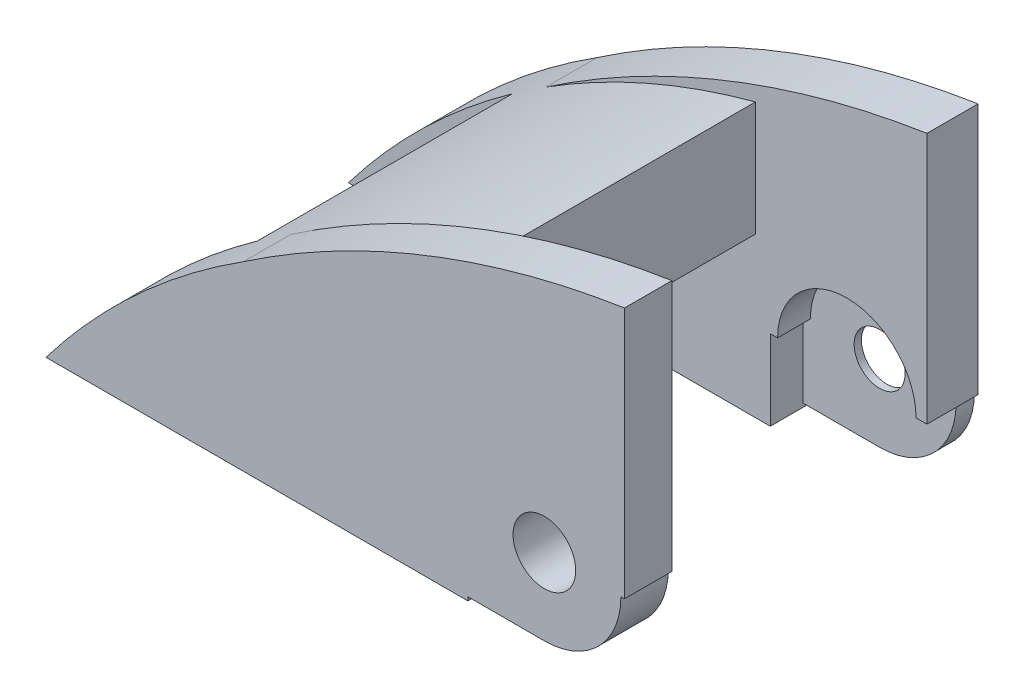
ISO-10303-21;
HEADER;
FILE_DESCRIPTION(('STEP AP214'),'2;1');
FILE_NAME('part.step','',(''),(''),'','','');
FILE_SCHEMA(('AUTOMOTIVE_DESIGN { 1 0 10303 214 1 1 1 1 }'));
ENDSEC;
DATA;
#1=APPLICATION_CONTEXT('core data for automotive mechanical design processes');
#2=APPLICATION_PROTOCOL_DEFINITION('international standard','automotive_design',2000,#1);
#3=PRODUCT_CONTEXT('',#1,'mechanical');
#4=PRODUCT('Part','Part','',(#3));
#5=PRODUCT_RELATED_PRODUCT_CATEGORY('part','',(#4));
#6=PRODUCT_DEFINITION_FORMATION('','',#4);
#7=PRODUCT_DEFINITION_CONTEXT('part definition',#1,'design');
#8=PRODUCT_DEFINITION('design','',#6,#7);
#9=PRODUCT_DEFINITION_SHAPE('','',#8);
#10=(LENGTH_UNIT() NAMED_UNIT(*) SI_UNIT(.MILLI.,.METRE.));
#11=(NAMED_UNIT(*) PLANE_ANGLE_UNIT() SI_UNIT($,.RADIAN.));
#12=(NAMED_UNIT(*) SI_UNIT($,.STERADIAN.) SOLID_ANGLE_UNIT());
#13=UNCERTAINTY_MEASURE_WITH_UNIT(LENGTH_MEASURE(1.E-05),#10,'distance_accuracy_value','');
#14=(GEOMETRIC_REPRESENTATION_CONTEXT(3) GLOBAL_UNCERTAINTY_ASSIGNED_CONTEXT((#13)) GLOBAL_UNIT_ASSIGNED_CONTEXT((#10,
#11,#12)) REPRESENTATION_CONTEXT('',''));
#15=CARTESIAN_POINT('',(0.,0.,0.));
#16=DIRECTION('',(0.,0.,1.));
#17=DIRECTION('',(1.,0.,0.));
#18=AXIS2_PLACEMENT_3D('',#15,#16,#17);
#19=CARTESIAN_POINT('',(0.,0.,48.5));
#20=DIRECTION('',(0.,0.,-1.));
#21=DIRECTION('',(1.,0.,0.));
#22=AXIS2_PLACEMENT_3D('',#19,#20,#21);
#23=CYLINDRICAL_SURFACE('',#22,3.5);
#24=CARTESIAN_POINT('',(0.,0.,2.5));
#25=DIRECTION('',(0.,0.,-1.));
#26=DIRECTION('',(0.,1.,0.));
#27=AXIS2_PLACEMENT_3D('',#24,#25,#26);
#28=CIRCLE('',#27,3.5);
#29=CARTESIAN_POINT('',(3.5,0.,2.50000000000001));
#30=VERTEX_POINT('',#29);
#31=EDGE_CURVE('E53',#30,#30,#28,.T.);
#32=CARTESIAN_POINT('',(0.,0.,1.5));
#33=DIRECTION('',(0.,0.,1.));
#34=DIRECTION('',(1.,0.,0.));
#35=AXIS2_PLACEMENT_3D('',#32,#33,#34);
#36=CIRCLE('',#35,3.5);
#37=CARTESIAN_POINT('',(3.5,0.,1.49999999999999));
#38=VERTEX_POINT('',#37);
#39=EDGE_CURVE('E245',#38,#38,#36,.F.);
#40=CARTESIAN_POINT('',(3.5,0.,2.50000000000001));
#41=CARTESIAN_POINT('',(3.5,0.,2.48958333333334));
#42=CARTESIAN_POINT('',(3.5,0.,2.47916666666667));
#43=CARTESIAN_POINT('',(3.5,0.,2.45833333333334));
#44=CARTESIAN_POINT('',(3.5,0.,2.44791666666667));
#45=CARTESIAN_POINT('',(3.5,0.,2.42708333333334));
#46=CARTESIAN_POINT('',(3.5,0.,2.41666666666667));
#47=CARTESIAN_POINT('',(3.5,0.,2.39583333333334));
#48=CARTESIAN_POINT('',(3.5,0.,2.38541666666667));
#49=CARTESIAN_POINT('',(3.5,0.,2.36458333333334));
#50=CARTESIAN_POINT('',(3.5,0.,2.35416666666667));
#51=CARTESIAN_POINT('',(3.5,0.,2.33333333333334));
#52=CARTESIAN_POINT('',(3.5,0.,2.32291666666667));
#53=CARTESIAN_POINT('',(3.5,0.,2.30208333333334));
#54=CARTESIAN_POINT('',(3.5,0.,2.29166666666667));
#55=CARTESIAN_POINT('',(3.5,0.,2.27083333333334));
#56=CARTESIAN_POINT('',(3.5,0.,2.26041666666667));
#57=CARTESIAN_POINT('',(3.5,0.,2.23958333333334));
#58=CARTESIAN_POINT('',(3.5,0.,2.22916666666667));
#59=CARTESIAN_POINT('',(3.5,0.,2.20833333333334));
#60=CARTESIAN_POINT('',(3.5,0.,2.19791666666667));
#61=CARTESIAN_POINT('',(3.5,0.,2.17708333333334));
#62=CARTESIAN_POINT('',(3.5,0.,2.16666666666667));
#63=CARTESIAN_POINT('',(3.5,0.,2.14583333333334));
#64=CARTESIAN_POINT('',(3.5,0.,2.13541666666667));
#65=CARTESIAN_POINT('',(3.5,0.,2.11458333333334));
#66=CARTESIAN_POINT('',(3.5,0.,2.10416666666667));
#67=CARTESIAN_POINT('',(3.5,0.,2.08333333333334));
#68=CARTESIAN_POINT('',(3.5,0.,2.07291666666667));
#69=CARTESIAN_POINT('',(3.5,0.,2.05208333333334));
#70=CARTESIAN_POINT('',(3.5,0.,2.04166666666667));
#71=CARTESIAN_POINT('',(3.5,0.,2.02083333333334));
#72=CARTESIAN_POINT('',(3.5,0.,2.01041666666667));
#73=CARTESIAN_POINT('',(3.5,0.,1.98958333333333));
#74=CARTESIAN_POINT('',(3.5,0.,1.97916666666667));
#75=CARTESIAN_POINT('',(3.5,0.,1.95833333333333));
#76=CARTESIAN_POINT('',(3.5,0.,1.94791666666667));
#77=CARTESIAN_POINT('',(3.5,0.,1.92708333333333));
#78=CARTESIAN_POINT('',(3.5,0.,1.91666666666667));
#79=CARTESIAN_POINT('',(3.5,0.,1.89583333333333));
#80=CARTESIAN_POINT('',(3.5,0.,1.88541666666667));
#81=CARTESIAN_POINT('',(3.5,0.,1.86458333333333));
#82=CARTESIAN_POINT('',(3.5,0.,1.85416666666667));
#83=CARTESIAN_POINT('',(3.5,0.,1.83333333333333));
#84=CARTESIAN_POINT('',(3.5,0.,1.82291666666667));
#85=CARTESIAN_POINT('',(3.5,0.,1.80208333333333));
#86=CARTESIAN_POINT('',(3.5,0.,1.79166666666667));
#87=CARTESIAN_POINT('',(3.5,0.,1.77083333333333));
#88=CARTESIAN_POINT('',(3.5,0.,1.76041666666666));
#89=CARTESIAN_POINT('',(3.5,0.,1.73958333333333));
#90=CARTESIAN_POINT('',(3.5,0.,1.72916666666666));
#91=CARTESIAN_POINT('',(3.5,0.,1.70833333333333));
#92=CARTESIAN_POINT('',(3.5,0.,1.69791666666666));
#93=CARTESIAN_POINT('',(3.5,0.,1.67708333333333));
#94=CARTESIAN_POINT('',(3.5,0.,1.66666666666666));
#95=CARTESIAN_POINT('',(3.5,0.,1.64583333333333));
#96=CARTESIAN_POINT('',(3.5,0.,1.63541666666666));
#97=CARTESIAN_POINT('',(3.5,0.,1.61458333333333));
#98=CARTESIAN_POINT('',(3.5,0.,1.60416666666666));
#99=CARTESIAN_POINT('',(3.5,0.,1.58333333333333));
#100=CARTESIAN_POINT('',(3.5,0.,1.57291666666666));
#101=CARTESIAN_POINT('',(3.5,0.,1.55208333333333));
#102=CARTESIAN_POINT('',(3.5,0.,1.54166666666666));
#103=CARTESIAN_POINT('',(3.5,0.,1.52083333333333));
#104=CARTESIAN_POINT('',(3.5,0.,1.51041666666666));
#105=CARTESIAN_POINT('',(3.5,0.,1.49999999999999));
#106=B_SPLINE_CURVE_WITH_KNOTS('',3,(#40,#41,#42,#43,#44,#45,#46,#47,#48,#49,#50,#51,#52,#53,
#54,#55,#56,#57,#58,#59,#60,#61,#62,#63,#64,#65,#66,#67,#68,#69,#70,#71,#72,#73,#74,#75,#76,#77,
#78,#79,#80,#81,#82,#83,#84,#85,#86,#87,#88,#89,#90,#91,#92,#93,#94,#95,#96,#97,#98,#99,#100,
#101,#102,#103,#104,#105),.UNSPECIFIED.,.F.,.F.,(4,2,2,2,2,2,2,2,2,2,2,2,2,2,2,2,2,2,2,2,2,2,2,
2,2,2,2,2,2,2,2,2,4),(0.,0.0312500000000035,0.0625000000000001,0.0937500000000036,0.125,
0.156250000000004,0.1875,0.218750000000004,0.25,0.281250000000004,0.312500000000007,
0.343750000000004,0.375000000000007,0.406250000000004,0.437500000000007,0.468750000000004,
0.500000000000007,0.531250000000011,0.562500000000007,0.593750000000011,0.625000000000008,
0.656250000000011,0.687500000000008,0.718750000000011,0.750000000000015,0.781250000000011,
0.812500000000015,0.843750000000011,0.875000000000015,0.906250000000011,0.937500000000015,
0.968750000000011,1.00000000000001),.UNSPECIFIED.);
#107=EDGE_CURVE('BSEAM49',#30,#38,#106,.T.);
#108=ORIENTED_EDGE('',*,*,#31,.F.);
#109=ORIENTED_EDGE('',*,*,#39,.T.);
#110=ORIENTED_EDGE('',*,*,#107,.T.);
#111=ORIENTED_EDGE('',*,*,#107,.F.);
#112=EDGE_LOOP('',(#108,#110,#109,#111));
#113=FACE_BOUND('',#112,.T.);
#114=ADVANCED_FACE('F49',(#113),#23,.F.);
#115=CARTESIAN_POINT('',(11.,0.,48.5));
#116=DIRECTION('',(-1.,0.,0.));
#117=DIRECTION('',(0.,0.,-1.));
#118=AXIS2_PLACEMENT_3D('',#115,#116,#117);
#119=PLANE('',#118);
#120=DIRECTION('',(0.,0.,1.));
#121=VECTOR('',#120,1.);
#122=CARTESIAN_POINT('',(11.,34.56,41.5));
#123=LINE('',#122,#121);
#124=CARTESIAN_POINT('',(11.,34.56,42.));
#125=VERTEX_POINT('',#124);
#126=CARTESIAN_POINT('',(11.,34.56,48.5));
#127=VERTEX_POINT('',#126);
#128=EDGE_CURVE('E326',#125,#127,#123,.T.);
#129=ORIENTED_EDGE('',*,*,#128,.T.);
#130=DIRECTION('',(0.,-1.,0.));
#131=VECTOR('',#130,1.);
#132=CARTESIAN_POINT('',(11.,0.,48.5));
#133=LINE('',#132,#131);
#134=CARTESIAN_POINT('',(11.,0.,48.5));
#135=VERTEX_POINT('',#134);
#136=EDGE_CURVE('E478',#127,#135,#133,.T.);
#137=ORIENTED_EDGE('',*,*,#136,.T.);
#138=DIRECTION('',(0.,0.,-1.));
#139=VECTOR('',#138,1.);
#140=CARTESIAN_POINT('',(11.,0.,48.5));
#141=LINE('',#140,#139);
#142=CARTESIAN_POINT('',(11.,0.,42.));
#143=VERTEX_POINT('',#142);
#144=EDGE_CURVE('E486',#135,#143,#141,.T.);
#145=ORIENTED_EDGE('',*,*,#144,.T.);
#146=DIRECTION('',(0.,1.,0.));
#147=VECTOR('',#146,1.);
#148=CARTESIAN_POINT('',(11.,0.,42.));
#149=LINE('',#148,#147);
#150=EDGE_CURVE('E460',#143,#125,#149,.T.);
#151=ORIENTED_EDGE('',*,*,#150,.T.);
#152=EDGE_LOOP('',(#129,#137,#145,#151));
#153=FACE_BOUND('',#152,.T.);
#154=ADVANCED_FACE('F525',(#153),#119,.F.);
#155=CARTESIAN_POINT('',(30.4889753081487,-91.3330173495402,41.5));
#156=DIRECTION('',(0.,0.,1.));
#157=DIRECTION('',(-1.,0.,0.));
#158=AXIS2_PLACEMENT_3D('',#155,#156,#157);
#159=CYLINDRICAL_SURFACE('',#158,127.392589956925);
#160=CARTESIAN_POINT('',(30.4889753081487,-91.3330173495402,42.));
#161=DIRECTION('',(0.,0.,1.));
#162=DIRECTION('',(1.,0.,0.));
#163=AXIS2_PLACEMENT_3D('',#160,#161,#162);
#164=CIRCLE('',#163,127.392589956925);
#165=CARTESIAN_POINT('',(-41.3051580301742,13.9023112912369,42.));
#166=VERTEX_POINT('',#165);
#167=EDGE_CURVE('E317',#125,#166,#164,.T.);
#168=ORIENTED_EDGE('',*,*,#167,.T.);
#169=DIRECTION('',(0.,0.,1.));
#170=VECTOR('',#169,1.);
#171=CARTESIAN_POINT('',(-41.3051580301743,13.9023112912369,41.5));
#172=LINE('',#171,#170);
#173=CARTESIAN_POINT('',(-41.3051580301743,13.9023112912369,48.5));
#174=VERTEX_POINT('',#173);
#175=EDGE_CURVE('E325',#166,#174,#172,.T.);
#176=ORIENTED_EDGE('',*,*,#175,.T.);
#177=CARTESIAN_POINT('',(30.4889753081487,-91.3330173495402,48.5));
#178=DIRECTION('',(0.,0.,1.));
#179=DIRECTION('',(1.,0.,0.));
#180=AXIS2_PLACEMENT_3D('',#177,#178,#179);
#181=CIRCLE('',#180,127.392589956925);
#182=EDGE_CURVE('E321',#127,#174,#181,.T.);
#183=ORIENTED_EDGE('',*,*,#182,.F.);
#184=ORIENTED_EDGE('',*,*,#128,.F.);
#185=EDGE_LOOP('',(#168,#176,#183,#184));
#186=FACE_BOUND('',#185,.T.);
#187=ADVANCED_FACE('F528',(#186),#159,.T.);
#188=CARTESIAN_POINT('',(14.2922228853993,-73.7218968301527,48.5));
#189=DIRECTION('',(0.,0.,-1.));
#190=DIRECTION('',(1.,0.,0.));
#191=AXIS2_PLACEMENT_3D('',#188,#189,#190);
#192=CYLINDRICAL_SURFACE('',#191,103.774132680413);
#193=DIRECTION('',(0.,0.,-1.));
#194=VECTOR('',#193,1.);
#195=CARTESIAN_POINT('',(-12.5312796553273,26.5256484017363,48.5));
#196=LINE('',#195,#194);
#197=CARTESIAN_POINT('',(-12.5312796553273,26.5256484017363,7.00000000000001));
#198=VERTEX_POINT('',#197);
#199=CARTESIAN_POINT('',(-12.5312796553273,26.5256484017363,42.));
#200=VERTEX_POINT('',#199);
#201=EDGE_CURVE('E439',#198,#200,#196,.F.);
#202=ORIENTED_EDGE('',*,*,#201,.F.);
#203=CARTESIAN_POINT('',(14.2922228853993,-73.7218968301527,7.));
#204=DIRECTION('',(0.,0.,1.));
#205=DIRECTION('',(1.,0.,0.));
#206=AXIS2_PLACEMENT_3D('',#203,#204,#205);
#207=CIRCLE('',#206,103.774132680413);
#208=CARTESIAN_POINT('',(-41.3051580301743,13.9023112912369,7.));
#209=VERTEX_POINT('',#208);
#210=EDGE_CURVE('E11',#198,#209,#207,.T.);
#211=ORIENTED_EDGE('',*,*,#210,.T.);
#212=DIRECTION('',(0.,0.,-1.));
#213=VECTOR('',#212,1.);
#214=CARTESIAN_POINT('',(-41.3051580301743,13.9023112912369,7.));
#215=LINE('',#214,#213);
#216=CARTESIAN_POINT('',(-41.3051580301742,13.902311291237,0.));
#217=VERTEX_POINT('',#216);
#218=EDGE_CURVE('E340',#209,#217,#215,.T.);
#219=ORIENTED_EDGE('',*,*,#218,.T.);
#220=CARTESIAN_POINT('',(14.2922228853993,-73.7218968301527,0.));
#221=DIRECTION('',(0.,0.,-1.));
#222=DIRECTION('',(-1.,0.,0.));
#223=AXIS2_PLACEMENT_3D('',#220,#221,#222);
#224=CIRCLE('',#223,103.774132680413);
#225=CARTESIAN_POINT('',(-68.3820431929861,-11.,0.));
#226=VERTEX_POINT('',#225);
#227=EDGE_CURVE('E415',#226,#217,#224,.T.);
#228=ORIENTED_EDGE('',*,*,#227,.F.);
#229=DIRECTION('',(0.,0.,-1.));
#230=VECTOR('',#229,1.);
#231=CARTESIAN_POINT('',(-68.3820431929861,-11.,48.5));
#232=LINE('',#231,#230);
#233=CARTESIAN_POINT('',(-68.3820431929861,-11.,7.00000000000001));
#234=VERTEX_POINT('',#233);
#235=EDGE_CURVE('E419',#234,#226,#232,.T.);
#236=ORIENTED_EDGE('',*,*,#235,.F.);
#237=CARTESIAN_POINT('',(14.2922228853993,-73.7218968301527,6.99999999999999));
#238=DIRECTION('',(0.,0.,1.));
#239=DIRECTION('',(0.,-1.,0.));
#240=AXIS2_PLACEMENT_3D('',#237,#238,#239);
#241=CIRCLE('',#240,103.774132680413);
#242=CARTESIAN_POINT('',(-45.882131556072,10.8246446787948,7.00000000000001));
#243=VERTEX_POINT('',#242);
#244=EDGE_CURVE('E435',#234,#243,#241,.F.);
#245=ORIENTED_EDGE('',*,*,#244,.T.);
#246=DIRECTION('',(0.,0.,-1.));
#247=VECTOR('',#246,1.);
#248=CARTESIAN_POINT('',(-45.882131556072,10.8246446787948,48.5));
#249=LINE('',#248,#247);
#250=CARTESIAN_POINT('',(-45.882131556072,10.8246446787948,42.));
#251=VERTEX_POINT('',#250);
#252=EDGE_CURVE('E427',#251,#243,#249,.T.);
#253=ORIENTED_EDGE('',*,*,#252,.F.);
#254=CARTESIAN_POINT('',(14.2922228853993,-73.7218968301527,42.));
#255=DIRECTION('',(0.,0.,1.));
#256=DIRECTION('',(1.,0.,0.));
#257=AXIS2_PLACEMENT_3D('',#254,#255,#256);
#258=CIRCLE('',#257,103.774132680413);
#259=CARTESIAN_POINT('',(-68.3820431929861,-11.,42.));
#260=VERTEX_POINT('',#259);
#261=EDGE_CURVE('E431',#260,#251,#258,.F.);
#262=ORIENTED_EDGE('',*,*,#261,.F.);
#263=CARTESIAN_POINT('',(-68.3820431929861,-11.,48.5));
#264=VERTEX_POINT('',#263);
#265=EDGE_CURVE('E423',#264,#260,#232,.T.);
#266=ORIENTED_EDGE('',*,*,#265,.F.);
#267=CARTESIAN_POINT('',(14.2922228853993,-73.7218968301527,48.5));
#268=DIRECTION('',(0.,0.,-1.));
#269=DIRECTION('',(-1.,0.,0.));
#270=AXIS2_PLACEMENT_3D('',#267,#268,#269);
#271=CIRCLE('',#270,103.774132680413);
#272=EDGE_CURVE('E416',#264,#174,#271,.T.);
#273=ORIENTED_EDGE('',*,*,#272,.T.);
#274=ORIENTED_EDGE('',*,*,#175,.F.);
#275=CARTESIAN_POINT('',(14.2922228853993,-73.7218968301527,42.));
#276=DIRECTION('',(0.,0.,1.));
#277=DIRECTION('',(1.,0.,0.));
#278=AXIS2_PLACEMENT_3D('',#275,#276,#277);
#279=CIRCLE('',#278,103.774132680413);
#280=EDGE_CURVE('E314',#200,#166,#279,.T.);
#281=ORIENTED_EDGE('',*,*,#280,.F.);
#282=EDGE_LOOP('',(#202,#211,#219,#228,#236,#245,#253,#262,#266,#273,#274,#281));
#283=FACE_BOUND('',#282,.T.);
#284=ADVANCED_FACE('F533',(#283),#192,.T.);
#285=CARTESIAN_POINT('',(12.,-12.,7.));
#286=DIRECTION('',(0.,0.,-1.));
#287=DIRECTION('',(0.,-1.,0.));
#288=AXIS2_PLACEMENT_3D('',#285,#286,#287);
#289=PLANE('',#288);
#290=DIRECTION('',(1.,0.,0.));
#291=VECTOR('',#290,1.);
#292=CARTESIAN_POINT('',(12.,0.,7.));
#293=LINE('',#292,#291);
#294=CARTESIAN_POINT('',(9.5,0.,7.));
#295=VERTEX_POINT('',#294);
#296=CARTESIAN_POINT('',(11.,0.,7.00000000000001));
#297=VERTEX_POINT('',#296);
#298=EDGE_CURVE('E403',#295,#297,#293,.T.);
#299=ORIENTED_EDGE('',*,*,#298,.T.);
#300=DIRECTION('',(0.,-1.,0.));
#301=VECTOR('',#300,1.);
#302=CARTESIAN_POINT('',(11.,-12.,7.));
#303=LINE('',#302,#301);
#304=CARTESIAN_POINT('',(11.,34.56,7.));
#305=VERTEX_POINT('',#304);
#306=EDGE_CURVE('E490',#305,#297,#303,.T.);
#307=ORIENTED_EDGE('',*,*,#306,.F.);
#308=CARTESIAN_POINT('',(30.4889753081487,-91.3330173495402,7.));
#309=DIRECTION('',(0.,0.,1.));
#310=DIRECTION('',(1.,0.,0.));
#311=AXIS2_PLACEMENT_3D('',#308,#309,#310);
#312=CIRCLE('',#311,127.392589956925);
#313=EDGE_CURVE('E334',#305,#209,#312,.T.);
#314=ORIENTED_EDGE('',*,*,#313,.T.);
#315=ORIENTED_EDGE('',*,*,#210,.F.);
#316=DIRECTION('',(0.,1.,0.));
#317=VECTOR('',#316,1.);
#318=CARTESIAN_POINT('',(-12.5312796553273,-12.,7.));
#319=LINE('',#318,#317);
#320=CARTESIAN_POINT('',(-12.5312796553273,10.8246446787948,7.));
#321=VERTEX_POINT('',#320);
#322=EDGE_CURVE('E457',#321,#198,#319,.T.);
#323=ORIENTED_EDGE('',*,*,#322,.F.);
#324=DIRECTION('',(1.,0.,0.));
#325=VECTOR('',#324,1.);
#326=CARTESIAN_POINT('',(12.,10.8246446787948,7.));
#327=LINE('',#326,#325);
#328=EDGE_CURVE('E450',#243,#321,#327,.T.);
#329=ORIENTED_EDGE('',*,*,#328,.F.);
#330=ORIENTED_EDGE('',*,*,#244,.F.);
#331=DIRECTION('',(-1.,0.,0.));
#332=VECTOR('',#331,1.);
#333=CARTESIAN_POINT('',(0.,-11.,7.));
#334=LINE('',#333,#332);
#335=CARTESIAN_POINT('',(-10.5,-11.,7.00000000000002));
#336=VERTEX_POINT('',#335);
#337=EDGE_CURVE('E472',#336,#234,#334,.T.);
#338=ORIENTED_EDGE('',*,*,#337,.F.);
#339=DIRECTION('',(0.,-1.,0.));
#340=VECTOR('',#339,1.);
#341=CARTESIAN_POINT('',(-10.5,-12.,7.));
#342=LINE('',#341,#340);
#343=CARTESIAN_POINT('',(-10.5,0.,7.));
#344=VERTEX_POINT('',#343);
#345=EDGE_CURVE('E396',#344,#336,#342,.T.);
#346=ORIENTED_EDGE('',*,*,#345,.F.);
#347=DIRECTION('',(-1.,0.,0.));
#348=VECTOR('',#347,1.);
#349=CARTESIAN_POINT('',(12.,0.,7.));
#350=LINE('',#349,#348);
#351=CARTESIAN_POINT('',(-9.5,0.,7.));
#352=VERTEX_POINT('',#351);
#353=EDGE_CURVE('E310',#352,#344,#350,.T.);
#354=ORIENTED_EDGE('',*,*,#353,.F.);
#355=CARTESIAN_POINT('',(0.,0.,7.));
#356=DIRECTION('',(0.,0.,-1.));
#357=DIRECTION('',(0.,1.,0.));
#358=AXIS2_PLACEMENT_3D('',#355,#356,#357);
#359=CIRCLE('',#358,9.5);
#360=EDGE_CURVE('E59',#352,#295,#359,.T.);
#361=ORIENTED_EDGE('',*,*,#360,.T.);
#362=EDGE_LOOP('',(#299,#307,#314,#315,#323,#329,#330,#338,#346,#354,#361));
#363=FACE_BOUND('',#362,.T.);
#364=ADVANCED_FACE('F517',(#363),#289,.F.);
#365=CARTESIAN_POINT('',(0.,0.,48.5));
#366=DIRECTION('',(0.,0.,1.));
#367=DIRECTION('',(-1.,0.,0.));
#368=AXIS2_PLACEMENT_3D('',#365,#366,#367);
#369=PLANE('',#368);
#370=CARTESIAN_POINT('',(0.,0.,48.5));
#371=DIRECTION('',(0.,0.,1.));
#372=DIRECTION('',(1.,0.,0.));
#373=AXIS2_PLACEMENT_3D('',#370,#371,#372);
#374=CIRCLE('',#373,4.3);
#375=CARTESIAN_POINT('',(4.3,0.,48.5));
#376=VERTEX_POINT('',#375);
#377=EDGE_CURVE('E280',#376,#376,#374,.T.);
#378=ORIENTED_EDGE('',*,*,#377,.F.);
#379=EDGE_LOOP('',(#378));
#380=FACE_BOUND('',#379,.T.);
#381=ORIENTED_EDGE('',*,*,#136,.F.);
#382=ORIENTED_EDGE('',*,*,#182,.T.);
#383=ORIENTED_EDGE('',*,*,#272,.F.);
#384=DIRECTION('',(-1.,0.,0.));
#385=VECTOR('',#384,1.);
#386=CARTESIAN_POINT('',(0.,-11.,48.5));
#387=LINE('',#386,#385);
#388=CARTESIAN_POINT('',(-10.5,-11.,48.5));
#389=VERTEX_POINT('',#388);
#390=EDGE_CURVE('E468',#389,#264,#387,.T.);
#391=ORIENTED_EDGE('',*,*,#390,.F.);
#392=DIRECTION('',(0.,-1.,0.));
#393=VECTOR('',#392,1.);
#394=CARTESIAN_POINT('',(-10.5,0.,48.5));
#395=LINE('',#394,#393);
#396=CARTESIAN_POINT('',(-10.5,-10.5,48.5));
#397=VERTEX_POINT('',#396);
#398=EDGE_CURVE('E356',#397,#389,#395,.T.);
#399=ORIENTED_EDGE('',*,*,#398,.F.);
#400=DIRECTION('',(-1.,0.,0.));
#401=VECTOR('',#400,1.);
#402=CARTESIAN_POINT('',(0.,-10.5,48.5));
#403=LINE('',#402,#401);
#404=CARTESIAN_POINT('',(0.,-10.5,48.5));
#405=VERTEX_POINT('',#404);
#406=EDGE_CURVE('E351',#405,#397,#403,.T.);
#407=ORIENTED_EDGE('',*,*,#406,.F.);
#408=CARTESIAN_POINT('',(0.,0.,48.5));
#409=DIRECTION('',(0.,0.,1.));
#410=DIRECTION('',(1.,0.,0.));
#411=AXIS2_PLACEMENT_3D('',#408,#409,#410);
#412=CIRCLE('',#411,10.5);
#413=CARTESIAN_POINT('',(10.5,0.,48.5));
#414=VERTEX_POINT('',#413);
#415=EDGE_CURVE('E347',#405,#414,#412,.T.);
#416=ORIENTED_EDGE('',*,*,#415,.T.);
#417=DIRECTION('',(1.,0.,0.));
#418=VECTOR('',#417,1.);
#419=CARTESIAN_POINT('',(0.,0.,48.5));
#420=LINE('',#419,#418);
#421=EDGE_CURVE('E360',#414,#135,#420,.T.);
#422=ORIENTED_EDGE('',*,*,#421,.T.);
#423=EDGE_LOOP('',(#381,#382,#383,#391,#399,#407,#416,#422));
#424=FACE_BOUND('',#423,.T.);
#425=ADVANCED_FACE('F514',(#380,#424),#369,.T.);
#426=CARTESIAN_POINT('',(0.,0.,42.));
#427=DIRECTION('',(0.,0.,-1.));
#428=DIRECTION('',(1.,0.,0.));
#429=AXIS2_PLACEMENT_3D('',#426,#427,#428);
#430=PLANE('',#429);
#431=CARTESIAN_POINT('',(0.,0.,42.));
#432=DIRECTION('',(0.,0.,1.));
#433=DIRECTION('',(1.,0.,0.));
#434=AXIS2_PLACEMENT_3D('',#431,#432,#433);
#435=CIRCLE('',#434,4.3);
#436=CARTESIAN_POINT('',(4.3,0.,42.));
#437=VERTEX_POINT('',#436);
#438=EDGE_CURVE('E284',#437,#437,#435,.T.);
#439=ORIENTED_EDGE('',*,*,#438,.T.);
#440=EDGE_LOOP('',(#439));
#441=FACE_BOUND('',#440,.T.);
#442=CARTESIAN_POINT('',(0.,0.,42.));
#443=DIRECTION('',(0.,0.,1.));
#444=DIRECTION('',(1.,0.,0.));
#445=AXIS2_PLACEMENT_3D('',#442,#443,#444);
#446=CIRCLE('',#445,10.5);
#447=CARTESIAN_POINT('',(0.,-10.5,42.));
#448=VERTEX_POINT('',#447);
#449=CARTESIAN_POINT('',(10.5,0.,42.));
#450=VERTEX_POINT('',#449);
#451=EDGE_CURVE('E411',#448,#450,#446,.T.);
#452=ORIENTED_EDGE('',*,*,#451,.F.);
#453=DIRECTION('',(-1.,0.,0.));
#454=VECTOR('',#453,1.);
#455=CARTESIAN_POINT('',(0.,-10.5,42.));
#456=LINE('',#455,#454);
#457=CARTESIAN_POINT('',(-10.5,-10.5,42.));
#458=VERTEX_POINT('',#457);
#459=EDGE_CURVE('E407',#448,#458,#456,.T.);
#460=ORIENTED_EDGE('',*,*,#459,.T.);
#461=DIRECTION('',(0.,-1.,0.));
#462=VECTOR('',#461,1.);
#463=CARTESIAN_POINT('',(-10.5,0.,42.));
#464=LINE('',#463,#462);
#465=CARTESIAN_POINT('',(-10.5,-11.,42.));
#466=VERTEX_POINT('',#465);
#467=EDGE_CURVE('E381',#458,#466,#464,.T.);
#468=ORIENTED_EDGE('',*,*,#467,.T.);
#469=DIRECTION('',(1.,0.,0.));
#470=VECTOR('',#469,1.);
#471=CARTESIAN_POINT('',(0.,-11.,42.));
#472=LINE('',#471,#470);
#473=EDGE_CURVE('E464',#260,#466,#472,.T.);
#474=ORIENTED_EDGE('',*,*,#473,.F.);
#475=ORIENTED_EDGE('',*,*,#261,.T.);
#476=DIRECTION('',(1.,0.,0.));
#477=VECTOR('',#476,1.);
#478=CARTESIAN_POINT('',(0.,10.8246446787948,42.));
#479=LINE('',#478,#477);
#480=CARTESIAN_POINT('',(-12.5312796553273,10.8246446787948,42.));
#481=VERTEX_POINT('',#480);
#482=EDGE_CURVE('E446',#251,#481,#479,.T.);
#483=ORIENTED_EDGE('',*,*,#482,.T.);
#484=DIRECTION('',(0.,1.,0.));
#485=VECTOR('',#484,1.);
#486=CARTESIAN_POINT('',(-12.5312796553273,0.,42.));
#487=LINE('',#486,#485);
#488=EDGE_CURVE('E454',#481,#200,#487,.T.);
#489=ORIENTED_EDGE('',*,*,#488,.T.);
#490=ORIENTED_EDGE('',*,*,#280,.T.);
#491=ORIENTED_EDGE('',*,*,#167,.F.);
#492=ORIENTED_EDGE('',*,*,#150,.F.);
#493=DIRECTION('',(1.,0.,0.));
#494=VECTOR('',#493,1.);
#495=CARTESIAN_POINT('',(0.,0.,42.));
#496=LINE('',#495,#494);
#497=EDGE_CURVE('E400',#450,#143,#496,.T.);
#498=ORIENTED_EDGE('',*,*,#497,.F.);
#499=EDGE_LOOP('',(#452,#460,#468,#474,#475,#483,#489,#490,#491,#492,#498));
#500=FACE_BOUND('',#499,.T.);
#501=ADVANCED_FACE('F504',(#441,#500),#430,.T.);
#502=CARTESIAN_POINT('',(0.,0.,0.));
#503=DIRECTION('',(0.,0.,-1.));
#504=DIRECTION('',(1.,0.,0.));
#505=AXIS2_PLACEMENT_3D('',#502,#503,#504);
#506=PLANE('',#505);
#507=CARTESIAN_POINT('',(0.,0.,0.));
#508=DIRECTION('',(0.,0.,1.));
#509=DIRECTION('',(1.,0.,0.));
#510=AXIS2_PLACEMENT_3D('',#507,#508,#509);
#511=CIRCLE('',#510,6.02637531229292);
#512=CARTESIAN_POINT('',(-0.563204585043083,-6.,0.));
#513=VERTEX_POINT('',#512);
#514=CARTESIAN_POINT('',(-0.563204585043085,6.,0.));
#515=VERTEX_POINT('',#514);
#516=EDGE_CURVE('E265',#513,#515,#511,.T.);
#517=ORIENTED_EDGE('',*,*,#516,.T.);
#518=DIRECTION('',(-1.,0.,0.));
#519=VECTOR('',#518,1.);
#520=CARTESIAN_POINT('',(0.,6.,0.));
#521=LINE('',#520,#519);
#522=CARTESIAN_POINT('',(-25.,6.,0.));
#523=VERTEX_POINT('',#522);
#524=EDGE_CURVE('E241',#515,#523,#521,.T.);
#525=ORIENTED_EDGE('',*,*,#524,.T.);
#526=DIRECTION('',(0.,-1.,0.));
#527=VECTOR('',#526,1.);
#528=CARTESIAN_POINT('',(-25.,0.,0.));
#529=LINE('',#528,#527);
#530=CARTESIAN_POINT('',(-25.,-6.,0.));
#531=VERTEX_POINT('',#530);
#532=EDGE_CURVE('E254',#523,#531,#529,.T.);
#533=ORIENTED_EDGE('',*,*,#532,.T.);
#534=DIRECTION('',(-1.,0.,0.));
#535=VECTOR('',#534,1.);
#536=CARTESIAN_POINT('',(0.,-6.,0.));
#537=LINE('',#536,#535);
#538=EDGE_CURVE('E250',#513,#531,#537,.T.);
#539=ORIENTED_EDGE('',*,*,#538,.F.);
#540=EDGE_LOOP('',(#517,#525,#533,#539));
#541=FACE_BOUND('',#540,.T.);
#542=CARTESIAN_POINT('',(0.,0.,0.));
#543=DIRECTION('',(0.,0.,1.));
#544=DIRECTION('',(1.,0.,0.));
#545=AXIS2_PLACEMENT_3D('',#542,#543,#544);
#546=CIRCLE('',#545,10.5);
#547=CARTESIAN_POINT('',(0.,-10.5,0.));
#548=VERTEX_POINT('',#547);
#549=CARTESIAN_POINT('',(10.5,0.,0.));
#550=VERTEX_POINT('',#549);
#551=EDGE_CURVE('E344',#548,#550,#546,.T.);
#552=ORIENTED_EDGE('',*,*,#551,.F.);
#553=DIRECTION('',(-1.,0.,0.));
#554=VECTOR('',#553,1.);
#555=CARTESIAN_POINT('',(0.,-10.5,0.));
#556=LINE('',#555,#554);
#557=CARTESIAN_POINT('',(-10.5,-10.5,0.));
#558=VERTEX_POINT('',#557);
#559=EDGE_CURVE('E367',#548,#558,#556,.T.);
#560=ORIENTED_EDGE('',*,*,#559,.T.);
#561=DIRECTION('',(0.,-1.,0.));
#562=VECTOR('',#561,1.);
#563=CARTESIAN_POINT('',(-10.5,0.,0.));
#564=LINE('',#563,#562);
#565=CARTESIAN_POINT('',(-10.5,-11.,0.));
#566=VERTEX_POINT('',#565);
#567=EDGE_CURVE('E371',#558,#566,#564,.T.);
#568=ORIENTED_EDGE('',*,*,#567,.T.);
#569=DIRECTION('',(-1.,0.,0.));
#570=VECTOR('',#569,1.);
#571=CARTESIAN_POINT('',(0.,-11.,0.));
#572=LINE('',#571,#570);
#573=EDGE_CURVE('E471',#566,#226,#572,.T.);
#574=ORIENTED_EDGE('',*,*,#573,.T.);
#575=ORIENTED_EDGE('',*,*,#227,.T.);
#576=CARTESIAN_POINT('',(30.4889753081487,-91.3330173495402,0.));
#577=DIRECTION('',(0.,0.,1.));
#578=DIRECTION('',(1.,0.,0.));
#579=AXIS2_PLACEMENT_3D('',#576,#577,#578);
#580=CIRCLE('',#579,127.392589956925);
#581=CARTESIAN_POINT('',(11.,34.56,0.));
#582=VERTEX_POINT('',#581);
#583=EDGE_CURVE('E330',#582,#217,#580,.T.);
#584=ORIENTED_EDGE('',*,*,#583,.F.);
#585=DIRECTION('',(0.,-1.,0.));
#586=VECTOR('',#585,1.);
#587=CARTESIAN_POINT('',(11.,0.,0.));
#588=LINE('',#587,#586);
#589=CARTESIAN_POINT('',(11.,0.,0.));
#590=VERTEX_POINT('',#589);
#591=EDGE_CURVE('E475',#582,#590,#588,.T.);
#592=ORIENTED_EDGE('',*,*,#591,.T.);
#593=DIRECTION('',(1.,0.,0.));
#594=VECTOR('',#593,1.);
#595=CARTESIAN_POINT('',(0.,0.,0.));
#596=LINE('',#595,#594);
#597=EDGE_CURVE('E352',#550,#590,#596,.T.);
#598=ORIENTED_EDGE('',*,*,#597,.F.);
#599=EDGE_LOOP('',(#552,#560,#568,#574,#575,#584,#592,#598));
#600=FACE_BOUND('',#599,.T.);
#601=ADVANCED_FACE('F570',(#541,#600),#506,.T.);
#602=CARTESIAN_POINT('',(0.,-11.,7.));
#603=DIRECTION('',(0.,1.,0.));
#604=DIRECTION('',(-1.,0.,0.));
#605=AXIS2_PLACEMENT_3D('',#602,#603,#604);
#606=PLANE('',#605);
#607=ORIENTED_EDGE('',*,*,#337,.T.);
#608=ORIENTED_EDGE('',*,*,#235,.T.);
#609=ORIENTED_EDGE('',*,*,#573,.F.);
#610=DIRECTION('',(0.,0.,-1.));
#611=VECTOR('',#610,1.);
#612=CARTESIAN_POINT('',(-10.5,-11.,48.5));
#613=LINE('',#612,#611);
#614=EDGE_CURVE('E386',#336,#566,#613,.T.);
#615=ORIENTED_EDGE('',*,*,#614,.F.);
#616=EDGE_LOOP('',(#607,#608,#609,#615));
#617=FACE_BOUND('',#616,.T.);
#618=ADVANCED_FACE('F617',(#617),#606,.F.);
#619=CARTESIAN_POINT('',(0.,0.,2.5));
#620=DIRECTION('',(0.,0.,1.));
#621=DIRECTION('',(0.,1.,0.));
#622=AXIS2_PLACEMENT_3D('',#619,#620,#621);
#623=PLANE('',#622);
#624=ORIENTED_EDGE('',*,*,#31,.T.);
#625=EDGE_LOOP('',(#624));
#626=FACE_BOUND('',#625,.T.);
#627=CARTESIAN_POINT('',(0.,0.,2.5));
#628=DIRECTION('',(0.,0.,-1.));
#629=DIRECTION('',(0.,1.,0.));
#630=AXIS2_PLACEMENT_3D('',#627,#628,#629);
#631=CIRCLE('',#630,9.5);
#632=CARTESIAN_POINT('',(-9.5,0.,2.5));
#633=VERTEX_POINT('',#632);
#634=CARTESIAN_POINT('',(9.5,0.,2.5));
#635=VERTEX_POINT('',#634);
#636=EDGE_CURVE('E494',#633,#635,#631,.T.);
#637=ORIENTED_EDGE('',*,*,#636,.F.);
#638=DIRECTION('',(1.,0.,0.));
#639=VECTOR('',#638,1.);
#640=CARTESIAN_POINT('',(0.,0.,2.5));
#641=LINE('',#640,#639);
#642=CARTESIAN_POINT('',(-10.5,0.,2.5));
#643=VERTEX_POINT('',#642);
#644=EDGE_CURVE('E293',#643,#633,#641,.T.);
#645=ORIENTED_EDGE('',*,*,#644,.F.);
#646=DIRECTION('',(0.,1.,0.));
#647=VECTOR('',#646,1.);
#648=CARTESIAN_POINT('',(-10.5,0.,2.5));
#649=LINE('',#648,#647);
#650=CARTESIAN_POINT('',(-10.5,-10.5,2.50000000000002));
#651=VERTEX_POINT('',#650);
#652=EDGE_CURVE('E294',#651,#643,#649,.T.);
#653=ORIENTED_EDGE('',*,*,#652,.F.);
#654=DIRECTION('',(1.,0.,0.));
#655=VECTOR('',#654,1.);
#656=CARTESIAN_POINT('',(0.,-10.5,2.5));
#657=LINE('',#656,#655);
#658=CARTESIAN_POINT('',(0.,-10.5,2.5));
#659=VERTEX_POINT('',#658);
#660=EDGE_CURVE('E285',#651,#659,#657,.T.);
#661=ORIENTED_EDGE('',*,*,#660,.T.);
#662=CARTESIAN_POINT('',(0.,0.,2.5));
#663=DIRECTION('',(0.,0.,1.));
#664=DIRECTION('',(1.,0.,0.));
#665=AXIS2_PLACEMENT_3D('',#662,#663,#664);
#666=CIRCLE('',#665,10.5);
#667=CARTESIAN_POINT('',(10.5,0.,2.5));
#668=VERTEX_POINT('',#667);
#669=EDGE_CURVE('E306',#668,#659,#666,.F.);
#670=ORIENTED_EDGE('',*,*,#669,.F.);
#671=EDGE_CURVE('E289',#635,#668,#641,.T.);
#672=ORIENTED_EDGE('',*,*,#671,.F.);
#673=EDGE_LOOP('',(#637,#645,#653,#661,#670,#672));
#674=FACE_BOUND('',#673,.T.);
#675=ADVANCED_FACE('F51',(#626,#674),#623,.T.);
#676=CARTESIAN_POINT('',(0.,0.,2.5));
#677=DIRECTION('',(0.,0.,1.));
#678=DIRECTION('',(0.,1.,0.));
#679=AXIS2_PLACEMENT_3D('',#676,#677,#678);
#680=CYLINDRICAL_SURFACE('',#679,9.5);
#681=ORIENTED_EDGE('',*,*,#360,.F.);
#682=DIRECTION('',(0.,0.,1.));
#683=VECTOR('',#682,1.);
#684=CARTESIAN_POINT('',(-9.5,0.,2.5));
#685=LINE('',#684,#683);
#686=EDGE_CURVE('E300',#633,#352,#685,.T.);
#687=ORIENTED_EDGE('',*,*,#686,.F.);
#688=ORIENTED_EDGE('',*,*,#636,.T.);
#689=DIRECTION('',(0.,0.,1.));
#690=VECTOR('',#689,1.);
#691=CARTESIAN_POINT('',(9.5,0.,2.5));
#692=LINE('',#691,#690);
#693=EDGE_CURVE('E303',#635,#295,#692,.T.);
#694=ORIENTED_EDGE('',*,*,#693,.T.);
#695=EDGE_LOOP('',(#681,#687,#688,#694));
#696=FACE_BOUND('',#695,.T.);
#697=ADVANCED_FACE('F593',(#696),#680,.F.);
#698=ORIENTED_EDGE('',*,*,#306,.T.);
#699=EDGE_CURVE('E482',#297,#590,#141,.T.);
#700=ORIENTED_EDGE('',*,*,#699,.T.);
#701=ORIENTED_EDGE('',*,*,#591,.F.);
#702=DIRECTION('',(0.,0.,-1.));
#703=VECTOR('',#702,1.);
#704=CARTESIAN_POINT('',(11.,34.56,7.));
#705=LINE('',#704,#703);
#706=EDGE_CURVE('E337',#305,#582,#705,.T.);
#707=ORIENTED_EDGE('',*,*,#706,.F.);
#708=EDGE_LOOP('',(#698,#700,#701,#707));
#709=FACE_BOUND('',#708,.T.);
#710=ADVANCED_FACE('F609',(#709),#119,.F.);
#711=ORIENTED_EDGE('',*,*,#390,.T.);
#712=ORIENTED_EDGE('',*,*,#265,.T.);
#713=ORIENTED_EDGE('',*,*,#473,.T.);
#714=EDGE_CURVE('E383',#389,#466,#613,.T.);
#715=ORIENTED_EDGE('',*,*,#714,.F.);
#716=EDGE_LOOP('',(#711,#712,#713,#715));
#717=FACE_BOUND('',#716,.T.);
#718=ADVANCED_FACE('F540',(#717),#606,.F.);
#719=CARTESIAN_POINT('',(-12.5312796553273,10.8246446787948,44.75));
#720=DIRECTION('',(1.,0.,0.));
#721=DIRECTION('',(0.,0.,1.));
#722=AXIS2_PLACEMENT_3D('',#719,#720,#721);
#723=PLANE('',#722);
#724=ORIENTED_EDGE('',*,*,#201,.T.);
#725=ORIENTED_EDGE('',*,*,#488,.F.);
#726=DIRECTION('',(0.,0.,-1.));
#727=VECTOR('',#726,1.);
#728=CARTESIAN_POINT('',(-12.5312796553273,10.8246446787948,44.75));
#729=LINE('',#728,#727);
#730=EDGE_CURVE('E443',#481,#321,#729,.T.);
#731=ORIENTED_EDGE('',*,*,#730,.T.);
#732=ORIENTED_EDGE('',*,*,#322,.T.);
#733=EDGE_LOOP('',(#724,#725,#731,#732));
#734=FACE_BOUND('',#733,.T.);
#735=ADVANCED_FACE('F556',(#734),#723,.T.);
#736=CARTESIAN_POINT('',(-47.5312796553273,10.8246446787948,44.75));
#737=DIRECTION('',(0.,-1.,0.));
#738=DIRECTION('',(0.,0.,1.));
#739=AXIS2_PLACEMENT_3D('',#736,#737,#738);
#740=PLANE('',#739);
#741=ORIENTED_EDGE('',*,*,#252,.T.);
#742=ORIENTED_EDGE('',*,*,#328,.T.);
#743=ORIENTED_EDGE('',*,*,#730,.F.);
#744=ORIENTED_EDGE('',*,*,#482,.F.);
#745=EDGE_LOOP('',(#741,#742,#743,#744));
#746=FACE_BOUND('',#745,.T.);
#747=ADVANCED_FACE('F637',(#746),#740,.T.);
#748=CARTESIAN_POINT('',(0.,0.,48.5));
#749=DIRECTION('',(0.,-1.,0.));
#750=DIRECTION('',(0.,0.,1.));
#751=AXIS2_PLACEMENT_3D('',#748,#749,#750);
#752=PLANE('',#751);
#753=DIRECTION('',(0.,0.,-1.));
#754=VECTOR('',#753,1.);
#755=CARTESIAN_POINT('',(10.5,0.,48.5));
#756=LINE('',#755,#754);
#757=EDGE_CURVE('E378',#414,#450,#756,.T.);
#758=ORIENTED_EDGE('',*,*,#757,.T.);
#759=ORIENTED_EDGE('',*,*,#497,.T.);
#760=ORIENTED_EDGE('',*,*,#144,.F.);
#761=ORIENTED_EDGE('',*,*,#421,.F.);
#762=EDGE_LOOP('',(#758,#759,#760,#761));
#763=FACE_BOUND('',#762,.T.);
#764=ADVANCED_FACE('F553',(#763),#752,.T.);
#765=CARTESIAN_POINT('',(-10.5,0.,48.5));
#766=DIRECTION('',(-1.,0.,0.));
#767=DIRECTION('',(0.,0.,-1.));
#768=AXIS2_PLACEMENT_3D('',#765,#766,#767);
#769=PLANE('',#768);
#770=ORIENTED_EDGE('',*,*,#467,.F.);
#771=DIRECTION('',(0.,0.,-1.));
#772=VECTOR('',#771,1.);
#773=CARTESIAN_POINT('',(-10.5,-10.5,48.5));
#774=LINE('',#773,#772);
#775=EDGE_CURVE('E387',#397,#458,#774,.T.);
#776=ORIENTED_EDGE('',*,*,#775,.F.);
#777=ORIENTED_EDGE('',*,*,#398,.T.);
#778=ORIENTED_EDGE('',*,*,#714,.T.);
#779=EDGE_LOOP('',(#770,#776,#777,#778));
#780=FACE_BOUND('',#779,.T.);
#781=ADVANCED_FACE('F543',(#780),#769,.F.);
#782=CARTESIAN_POINT('',(0.,-10.5,48.5));
#783=DIRECTION('',(0.,1.,0.));
#784=DIRECTION('',(0.,0.,-1.));
#785=AXIS2_PLACEMENT_3D('',#782,#783,#784);
#786=PLANE('',#785);
#787=ORIENTED_EDGE('',*,*,#459,.F.);
#788=DIRECTION('',(0.,0.,-1.));
#789=VECTOR('',#788,1.);
#790=CARTESIAN_POINT('',(0.,-10.5,48.5));
#791=LINE('',#790,#789);
#792=EDGE_CURVE('E390',#405,#448,#791,.T.);
#793=ORIENTED_EDGE('',*,*,#792,.F.);
#794=ORIENTED_EDGE('',*,*,#406,.T.);
#795=ORIENTED_EDGE('',*,*,#775,.T.);
#796=EDGE_LOOP('',(#787,#793,#794,#795));
#797=FACE_BOUND('',#796,.T.);
#798=ADVANCED_FACE('F546',(#797),#786,.F.);
#799=CARTESIAN_POINT('',(0.,0.,48.5));
#800=DIRECTION('',(0.,0.,-1.));
#801=DIRECTION('',(1.,0.,0.));
#802=AXIS2_PLACEMENT_3D('',#799,#800,#801);
#803=CYLINDRICAL_SURFACE('',#802,10.5);
#804=ORIENTED_EDGE('',*,*,#792,.T.);
#805=ORIENTED_EDGE('',*,*,#451,.T.);
#806=ORIENTED_EDGE('',*,*,#757,.F.);
#807=ORIENTED_EDGE('',*,*,#415,.F.);
#808=EDGE_LOOP('',(#804,#805,#806,#807));
#809=FACE_BOUND('',#808,.T.);
#810=ADVANCED_FACE('F549',(#809),#803,.T.);
#811=ORIENTED_EDGE('',*,*,#669,.T.);
#812=EDGE_CURVE('E363',#659,#548,#791,.T.);
#813=ORIENTED_EDGE('',*,*,#812,.T.);
#814=ORIENTED_EDGE('',*,*,#551,.T.);
#815=EDGE_CURVE('E382',#668,#550,#756,.T.);
#816=ORIENTED_EDGE('',*,*,#815,.F.);
#817=EDGE_LOOP('',(#811,#813,#814,#816));
#818=FACE_BOUND('',#817,.T.);
#819=ADVANCED_FACE('F603',(#818),#803,.T.);
#820=EDGE_CURVE('E75',#651,#558,#774,.T.);
#821=ORIENTED_EDGE('',*,*,#820,.T.);
#822=ORIENTED_EDGE('',*,*,#559,.F.);
#823=ORIENTED_EDGE('',*,*,#812,.F.);
#824=ORIENTED_EDGE('',*,*,#660,.F.);
#825=EDGE_LOOP('',(#821,#822,#823,#824));
#826=FACE_BOUND('',#825,.T.);
#827=ADVANCED_FACE('F600',(#826),#786,.F.);
#828=ORIENTED_EDGE('',*,*,#815,.T.);
#829=ORIENTED_EDGE('',*,*,#597,.T.);
#830=ORIENTED_EDGE('',*,*,#699,.F.);
#831=ORIENTED_EDGE('',*,*,#298,.F.);
#832=ORIENTED_EDGE('',*,*,#693,.F.);
#833=ORIENTED_EDGE('',*,*,#671,.T.);
#834=EDGE_LOOP('',(#828,#829,#830,#831,#832,#833));
#835=FACE_BOUND('',#834,.T.);
#836=ADVANCED_FACE('F606',(#835),#752,.T.);
#837=ORIENTED_EDGE('',*,*,#345,.T.);
#838=ORIENTED_EDGE('',*,*,#614,.T.);
#839=ORIENTED_EDGE('',*,*,#567,.F.);
#840=ORIENTED_EDGE('',*,*,#820,.F.);
#841=ORIENTED_EDGE('',*,*,#652,.T.);
#842=DIRECTION('',(0.,0.,1.));
#843=VECTOR('',#842,1.);
#844=CARTESIAN_POINT('',(-10.5,0.,2.5));
#845=LINE('',#844,#843);
#846=EDGE_CURVE('E297',#643,#344,#845,.T.);
#847=ORIENTED_EDGE('',*,*,#846,.T.);
#848=EDGE_LOOP('',(#837,#838,#839,#840,#841,#847));
#849=FACE_BOUND('',#848,.T.);
#850=ADVANCED_FACE('F598',(#849),#769,.F.);
#851=CARTESIAN_POINT('',(30.4889753081487,-91.3330173495402,7.));
#852=DIRECTION('',(0.,0.,-1.));
#853=DIRECTION('',(1.,0.,0.));
#854=AXIS2_PLACEMENT_3D('',#851,#852,#853);
#855=CYLINDRICAL_SURFACE('',#854,127.392589956925);
#856=ORIENTED_EDGE('',*,*,#583,.T.);
#857=ORIENTED_EDGE('',*,*,#218,.F.);
#858=ORIENTED_EDGE('',*,*,#313,.F.);
#859=ORIENTED_EDGE('',*,*,#706,.T.);
#860=EDGE_LOOP('',(#856,#857,#858,#859));
#861=FACE_BOUND('',#860,.T.);
#862=ADVANCED_FACE('F565',(#861),#855,.T.);
#863=CARTESIAN_POINT('',(0.,0.,2.5));
#864=DIRECTION('',(0.,1.,0.));
#865=DIRECTION('',(0.,0.,-1.));
#866=AXIS2_PLACEMENT_3D('',#863,#864,#865);
#867=PLANE('',#866);
#868=ORIENTED_EDGE('',*,*,#686,.T.);
#869=ORIENTED_EDGE('',*,*,#353,.T.);
#870=ORIENTED_EDGE('',*,*,#846,.F.);
#871=ORIENTED_EDGE('',*,*,#644,.T.);
#872=EDGE_LOOP('',(#868,#869,#870,#871));
#873=FACE_BOUND('',#872,.T.);
#874=ADVANCED_FACE('F510',(#873),#867,.F.);
#875=CARTESIAN_POINT('',(0.,0.,48.5));
#876=DIRECTION('',(0.,0.,-1.));
#877=DIRECTION('',(1.,0.,0.));
#878=AXIS2_PLACEMENT_3D('',#875,#876,#877);
#879=CYLINDRICAL_SURFACE('',#878,4.3);
#880=CARTESIAN_POINT('',(4.3,0.,42.));
#881=CARTESIAN_POINT('',(4.3,0.,42.0677083333333));
#882=CARTESIAN_POINT('',(4.3,0.,42.1354166666667));
#883=CARTESIAN_POINT('',(4.3,0.,42.2708333333333));
#884=CARTESIAN_POINT('',(4.3,0.,42.3385416666667));
#885=CARTESIAN_POINT('',(4.3,0.,42.4739583333333));
#886=CARTESIAN_POINT('',(4.3,0.,42.5416666666667));
#887=CARTESIAN_POINT('',(4.3,0.,42.6770833333333));
#888=CARTESIAN_POINT('',(4.3,0.,42.7447916666667));
#889=CARTESIAN_POINT('',(4.3,0.,42.8802083333333));
#890=CARTESIAN_POINT('',(4.3,0.,42.9479166666667));
#891=CARTESIAN_POINT('',(4.3,0.,43.0833333333333));
#892=CARTESIAN_POINT('',(4.3,0.,43.1510416666667));
#893=CARTESIAN_POINT('',(4.3,0.,43.2864583333333));
#894=CARTESIAN_POINT('',(4.3,0.,43.3541666666667));
#895=CARTESIAN_POINT('',(4.3,0.,43.4895833333333));
#896=CARTESIAN_POINT('',(4.3,0.,43.5572916666667));
#897=CARTESIAN_POINT('',(4.3,0.,43.6927083333333));
#898=CARTESIAN_POINT('',(4.3,0.,43.7604166666667));
#899=CARTESIAN_POINT('',(4.3,0.,43.8958333333333));
#900=CARTESIAN_POINT('',(4.3,0.,43.9635416666667));
#901=CARTESIAN_POINT('',(4.3,0.,44.0989583333333));
#902=CARTESIAN_POINT('',(4.3,0.,44.1666666666667));
#903=CARTESIAN_POINT('',(4.3,0.,44.3020833333333));
#904=CARTESIAN_POINT('',(4.3,0.,44.3697916666667));
#905=CARTESIAN_POINT('',(4.3,0.,44.5052083333333));
#906=CARTESIAN_POINT('',(4.3,0.,44.5729166666667));
#907=CARTESIAN_POINT('',(4.3,0.,44.7083333333333));
#908=CARTESIAN_POINT('',(4.3,0.,44.7760416666667));
#909=CARTESIAN_POINT('',(4.3,0.,44.9114583333333));
#910=CARTESIAN_POINT('',(4.3,0.,44.9791666666667));
#911=CARTESIAN_POINT('',(4.3,0.,45.1145833333333));
#912=CARTESIAN_POINT('',(4.3,0.,45.1822916666667));
#913=CARTESIAN_POINT('',(4.3,0.,45.3177083333333));
#914=CARTESIAN_POINT('',(4.3,0.,45.3854166666667));
#915=CARTESIAN_POINT('',(4.3,0.,45.5208333333333));
#916=CARTESIAN_POINT('',(4.3,0.,45.5885416666667));
#917=CARTESIAN_POINT('',(4.3,0.,45.7239583333333));
#918=CARTESIAN_POINT('',(4.3,0.,45.7916666666667));
#919=CARTESIAN_POINT('',(4.3,0.,45.9270833333333));
#920=CARTESIAN_POINT('',(4.3,0.,45.9947916666667));
#921=CARTESIAN_POINT('',(4.3,0.,46.1302083333333));
#922=CARTESIAN_POINT('',(4.3,0.,46.1979166666667));
#923=CARTESIAN_POINT('',(4.3,0.,46.3333333333333));
#924=CARTESIAN_POINT('',(4.3,0.,46.4010416666667));
#925=CARTESIAN_POINT('',(4.3,0.,46.5364583333333));
#926=CARTESIAN_POINT('',(4.3,0.,46.6041666666667));
#927=CARTESIAN_POINT('',(4.3,0.,46.7395833333333));
#928=CARTESIAN_POINT('',(4.3,0.,46.8072916666667));
#929=CARTESIAN_POINT('',(4.3,0.,46.9427083333333));
#930=CARTESIAN_POINT('',(4.3,0.,47.0104166666667));
#931=CARTESIAN_POINT('',(4.3,0.,47.1458333333333));
#932=CARTESIAN_POINT('',(4.3,0.,47.2135416666667));
#933=CARTESIAN_POINT('',(4.3,0.,47.3489583333333));
#934=CARTESIAN_POINT('',(4.3,0.,47.4166666666667));
#935=CARTESIAN_POINT('',(4.3,0.,47.5520833333333));
#936=CARTESIAN_POINT('',(4.3,0.,47.6197916666667));
#937=CARTESIAN_POINT('',(4.3,0.,47.7552083333333));
#938=CARTESIAN_POINT('',(4.3,0.,47.8229166666667));
#939=CARTESIAN_POINT('',(4.3,0.,47.9583333333333));
#940=CARTESIAN_POINT('',(4.3,0.,48.0260416666667));
#941=CARTESIAN_POINT('',(4.3,0.,48.1614583333333));
#942=CARTESIAN_POINT('',(4.3,0.,48.2291666666667));
#943=CARTESIAN_POINT('',(4.3,0.,48.3645833333333));
#944=CARTESIAN_POINT('',(4.3,0.,48.4322916666667));
#945=CARTESIAN_POINT('',(4.3,0.,48.5));
#946=B_SPLINE_CURVE_WITH_KNOTS('',3,(#880,#881,#882,#883,#884,#885,#886,#887,#888,#889,#890,
#891,#892,#893,#894,#895,#896,#897,#898,#899,#900,#901,#902,#903,#904,#905,#906,#907,#908,#909,
#910,#911,#912,#913,#914,#915,#916,#917,#918,#919,#920,#921,#922,#923,#924,#925,#926,#927,#928,
#929,#930,#931,#932,#933,#934,#935,#936,#937,#938,#939,#940,#941,#942,#943,#944,#945),
.UNSPECIFIED.,.F.,.F.,(4,2,2,2,2,2,2,2,2,2,2,2,2,2,2,2,2,2,2,2,2,2,2,2,2,2,2,2,2,2,2,2,4),(0.,
0.203124999999998,0.406249999999997,0.609374999999995,0.812500000000001,1.015625,1.21875,
1.421875,1.62499999999999,1.828125,2.03125,2.234375,2.4375,2.64062499999999,2.84375,3.046875,
3.25,3.45312499999999,3.65624999999999,3.859375,4.0625,4.26562499999999,4.46874999999999,
4.671875,4.875,5.078125,5.28124999999999,5.48437499999999,5.6875,5.890625,6.09374999999999,
6.29687499999999,6.5),.UNSPECIFIED.);
#947=EDGE_CURVE('BSEAM507',#437,#376,#946,.T.);
#948=ORIENTED_EDGE('',*,*,#438,.F.);
#949=ORIENTED_EDGE('',*,*,#377,.T.);
#950=ORIENTED_EDGE('',*,*,#947,.T.);
#951=ORIENTED_EDGE('',*,*,#947,.F.);
#952=EDGE_LOOP('',(#948,#950,#949,#951));
#953=FACE_BOUND('',#952,.T.);
#954=ADVANCED_FACE('F507',(#953),#879,.F.);
#955=CARTESIAN_POINT('',(0.,0.,1.5));
#956=DIRECTION('',(0.,0.,-1.));
#957=DIRECTION('',(1.,0.,0.));
#958=AXIS2_PLACEMENT_3D('',#955,#956,#957);
#959=CYLINDRICAL_SURFACE('',#958,6.02637531229292);
#960=ORIENTED_EDGE('',*,*,#516,.F.);
#961=DIRECTION('',(0.,0.,-1.));
#962=VECTOR('',#961,1.);
#963=CARTESIAN_POINT('',(-0.563204585043083,-6.,1.5));
#964=LINE('',#963,#962);
#965=CARTESIAN_POINT('',(-0.563204585043083,-6.,1.5));
#966=VERTEX_POINT('',#965);
#967=EDGE_CURVE('E248',#966,#513,#964,.T.);
#968=ORIENTED_EDGE('',*,*,#967,.F.);
#969=CARTESIAN_POINT('',(0.,0.,1.5));
#970=DIRECTION('',(0.,0.,1.));
#971=DIRECTION('',(1.,0.,0.));
#972=AXIS2_PLACEMENT_3D('',#969,#970,#971);
#973=CIRCLE('',#972,6.02637531229292);
#974=CARTESIAN_POINT('',(-0.563204585043085,6.,1.5));
#975=VERTEX_POINT('',#974);
#976=EDGE_CURVE('E232',#966,#975,#973,.T.);
#977=ORIENTED_EDGE('',*,*,#976,.T.);
#978=DIRECTION('',(0.,0.,-1.));
#979=VECTOR('',#978,1.);
#980=CARTESIAN_POINT('',(-0.563204585043085,6.,1.5));
#981=LINE('',#980,#979);
#982=EDGE_CURVE('E67',#975,#515,#981,.T.);
#983=ORIENTED_EDGE('',*,*,#982,.T.);
#984=EDGE_LOOP('',(#960,#968,#977,#983));
#985=FACE_BOUND('',#984,.T.);
#986=ADVANCED_FACE('F247',(#985),#959,.F.);
#987=CARTESIAN_POINT('',(0.,-6.,1.5));
#988=DIRECTION('',(0.,1.,0.));
#989=DIRECTION('',(-1.,0.,0.));
#990=AXIS2_PLACEMENT_3D('',#987,#988,#989);
#991=PLANE('',#990);
#992=ORIENTED_EDGE('',*,*,#538,.T.);
#993=DIRECTION('',(0.,0.,-1.));
#994=VECTOR('',#993,1.);
#995=CARTESIAN_POINT('',(-25.,-6.,1.5));
#996=LINE('',#995,#994);
#997=CARTESIAN_POINT('',(-25.,-6.,1.5));
#998=VERTEX_POINT('',#997);
#999=EDGE_CURVE('E275',#998,#531,#996,.T.);
#1000=ORIENTED_EDGE('',*,*,#999,.F.);
#1001=DIRECTION('',(-1.,0.,0.));
#1002=VECTOR('',#1001,1.);
#1003=CARTESIAN_POINT('',(0.,-6.,1.5));
#1004=LINE('',#1003,#1002);
#1005=EDGE_CURVE('E259',#966,#998,#1004,.T.);
#1006=ORIENTED_EDGE('',*,*,#1005,.F.);
#1007=ORIENTED_EDGE('',*,*,#967,.T.);
#1008=EDGE_LOOP('',(#992,#1000,#1006,#1007));
#1009=FACE_BOUND('',#1008,.T.);
#1010=ADVANCED_FACE('F880',(#1009),#991,.T.);
#1011=CARTESIAN_POINT('',(-25.,0.,1.5));
#1012=DIRECTION('',(-1.,0.,0.));
#1013=DIRECTION('',(0.,0.,-1.));
#1014=AXIS2_PLACEMENT_3D('',#1011,#1012,#1013);
#1015=PLANE('',#1014);
#1016=ORIENTED_EDGE('',*,*,#532,.F.);
#1017=DIRECTION('',(0.,0.,-1.));
#1018=VECTOR('',#1017,1.);
#1019=CARTESIAN_POINT('',(-25.,6.,1.5));
#1020=LINE('',#1019,#1018);
#1021=CARTESIAN_POINT('',(-25.,6.,1.5));
#1022=VERTEX_POINT('',#1021);
#1023=EDGE_CURVE('E244',#1022,#523,#1020,.T.);
#1024=ORIENTED_EDGE('',*,*,#1023,.F.);
#1025=DIRECTION('',(0.,-1.,0.));
#1026=VECTOR('',#1025,1.);
#1027=CARTESIAN_POINT('',(-25.,0.,1.5));
#1028=LINE('',#1027,#1026);
#1029=EDGE_CURVE('E234',#1022,#998,#1028,.T.);
#1030=ORIENTED_EDGE('',*,*,#1029,.T.);
#1031=ORIENTED_EDGE('',*,*,#999,.T.);
#1032=EDGE_LOOP('',(#1016,#1024,#1030,#1031));
#1033=FACE_BOUND('',#1032,.T.);
#1034=ADVANCED_FACE('F888',(#1033),#1015,.F.);
#1035=CARTESIAN_POINT('',(0.,6.,1.5));
#1036=DIRECTION('',(0.,1.,0.));
#1037=DIRECTION('',(-1.,0.,0.));
#1038=AXIS2_PLACEMENT_3D('',#1035,#1036,#1037);
#1039=PLANE('',#1038);
#1040=ORIENTED_EDGE('',*,*,#524,.F.);
#1041=ORIENTED_EDGE('',*,*,#982,.F.);
#1042=DIRECTION('',(-1.,0.,0.));
#1043=VECTOR('',#1042,1.);
#1044=CARTESIAN_POINT('',(0.,6.,1.5));
#1045=LINE('',#1044,#1043);
#1046=EDGE_CURVE('E228',#975,#1022,#1045,.T.);
#1047=ORIENTED_EDGE('',*,*,#1046,.T.);
#1048=ORIENTED_EDGE('',*,*,#1023,.T.);
#1049=EDGE_LOOP('',(#1040,#1041,#1047,#1048));
#1050=FACE_BOUND('',#1049,.T.);
#1051=ADVANCED_FACE('F239',(#1050),#1039,.F.);
#1052=CARTESIAN_POINT('',(0.,0.,1.5));
#1053=DIRECTION('',(0.,0.,-1.));
#1054=DIRECTION('',(1.,0.,0.));
#1055=AXIS2_PLACEMENT_3D('',#1052,#1053,#1054);
#1056=PLANE('',#1055);
#1057=ORIENTED_EDGE('',*,*,#976,.F.);
#1058=ORIENTED_EDGE('',*,*,#1005,.T.);
#1059=ORIENTED_EDGE('',*,*,#1029,.F.);
#1060=ORIENTED_EDGE('',*,*,#1046,.F.);
#1061=EDGE_LOOP('',(#1057,#1058,#1059,#1060));
#1062=FACE_BOUND('',#1061,.T.);
#1063=ORIENTED_EDGE('',*,*,#39,.F.);
#1064=EDGE_LOOP('',(#1063));
#1065=FACE_BOUND('',#1064,.T.);
#1066=ADVANCED_FACE('F229',(#1062,#1065),#1056,.T.);
#1067=CLOSED_SHELL('',(#114,#154,#187,#284,#364,#425,#501,#601,#618,#675,#697,#710,#718,#735,
#747,#764,#781,#798,#810,#819,#827,#836,#850,#862,#874,#954,#986,#1010,#1034,#1051,#1066));
#1068=MANIFOLD_SOLID_BREP('B2',#1067);
#1069=ADVANCED_BREP_SHAPE_REPRESENTATION('',(#18,#1068),#14);
#1070=SHAPE_DEFINITION_REPRESENTATION(#9,#1069);
ENDSEC;
END-ISO-10303-21;
